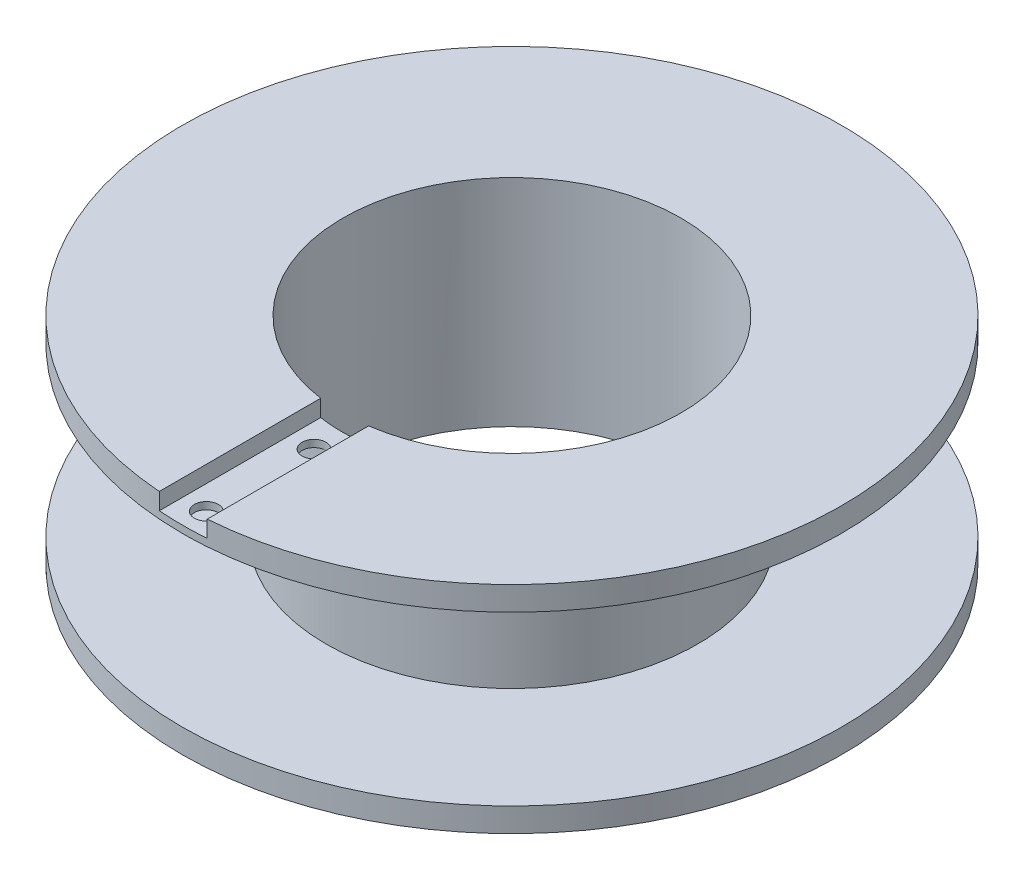
ISO-10303-21;
HEADER;
FILE_DESCRIPTION(('STEP AP214'),'2;1');
FILE_NAME('part.step','',(''),(''),'','','');
FILE_SCHEMA(('AUTOMOTIVE_DESIGN { 1 0 10303 214 1 1 1 1 }'));
ENDSEC;
DATA;
#1=APPLICATION_CONTEXT('core data for automotive mechanical design processes');
#2=APPLICATION_PROTOCOL_DEFINITION('international standard','automotive_design',2000,#1);
#3=PRODUCT_CONTEXT('',#1,'mechanical');
#4=PRODUCT('Part','Part','',(#3));
#5=PRODUCT_RELATED_PRODUCT_CATEGORY('part','',(#4));
#6=PRODUCT_DEFINITION_FORMATION('','',#4);
#7=PRODUCT_DEFINITION_CONTEXT('part definition',#1,'design');
#8=PRODUCT_DEFINITION('design','',#6,#7);
#9=PRODUCT_DEFINITION_SHAPE('','',#8);
#10=(LENGTH_UNIT() NAMED_UNIT(*) SI_UNIT(.MILLI.,.METRE.));
#11=(NAMED_UNIT(*) PLANE_ANGLE_UNIT() SI_UNIT($,.RADIAN.));
#12=(NAMED_UNIT(*) SI_UNIT($,.STERADIAN.) SOLID_ANGLE_UNIT());
#13=UNCERTAINTY_MEASURE_WITH_UNIT(LENGTH_MEASURE(1.E-05),#10,'distance_accuracy_value','');
#14=(GEOMETRIC_REPRESENTATION_CONTEXT(3) GLOBAL_UNCERTAINTY_ASSIGNED_CONTEXT((#13)) GLOBAL_UNIT_ASSIGNED_CONTEXT((#10,
#11,#12)) REPRESENTATION_CONTEXT('',''));
#15=CARTESIAN_POINT('',(0.,0.,0.));
#16=DIRECTION('',(0.,0.,1.));
#17=DIRECTION('',(1.,0.,0.));
#18=AXIS2_PLACEMENT_3D('',#15,#16,#17);
#19=CARTESIAN_POINT('',(0.,9.,0.));
#20=DIRECTION('',(0.,-1.,0.));
#21=DIRECTION('',(0.,0.,-1.));
#22=AXIS2_PLACEMENT_3D('',#19,#20,#21);
#23=CYLINDRICAL_SURFACE('',#22,13.75);
#24=CARTESIAN_POINT('',(0.,0.,0.));
#25=DIRECTION('',(0.,1.,0.));
#26=DIRECTION('',(0.,0.,1.));
#27=AXIS2_PLACEMENT_3D('',#24,#25,#26);
#28=CIRCLE('',#27,13.75);
#29=CARTESIAN_POINT('',(0.,0.,13.75));
#30=VERTEX_POINT('',#29);
#31=EDGE_CURVE('E110',#30,#30,#28,.T.);
#32=ORIENTED_EDGE('',*,*,#31,.T.);
#33=EDGE_LOOP('',(#32));
#34=FACE_BOUND('',#33,.T.);
#35=CARTESIAN_POINT('',(0.,0.999999999999999,0.));
#36=DIRECTION('',(0.,1.,0.));
#37=DIRECTION('',(0.,0.,1.));
#38=AXIS2_PLACEMENT_3D('',#35,#36,#37);
#39=CIRCLE('',#38,13.75);
#40=CARTESIAN_POINT('',(0.,0.999999999999999,13.75));
#41=VERTEX_POINT('',#40);
#42=EDGE_CURVE('E113',#41,#41,#39,.T.);
#43=ORIENTED_EDGE('',*,*,#42,.F.);
#44=EDGE_LOOP('',(#43));
#45=FACE_BOUND('',#44,.T.);
#46=ADVANCED_FACE('F33',(#34,#45),#23,.T.);
#47=CARTESIAN_POINT('',(0.,0.,0.));
#48=DIRECTION('',(0.,1.,0.));
#49=DIRECTION('',(0.,0.,1.));
#50=AXIS2_PLACEMENT_3D('',#47,#48,#49);
#51=PLANE('',#50);
#52=CARTESIAN_POINT('',(0.,0.,0.));
#53=DIRECTION('',(0.,1.,0.));
#54=DIRECTION('',(0.,0.,1.));
#55=AXIS2_PLACEMENT_3D('',#52,#53,#54);
#56=CIRCLE('',#55,7.05);
#57=CARTESIAN_POINT('',(0.,0.,7.05));
#58=VERTEX_POINT('',#57);
#59=EDGE_CURVE('E92',#58,#58,#56,.F.);
#60=ORIENTED_EDGE('',*,*,#59,.F.);
#61=EDGE_LOOP('',(#60));
#62=FACE_BOUND('',#61,.T.);
#63=ORIENTED_EDGE('',*,*,#31,.F.);
#64=EDGE_LOOP('',(#63));
#65=FACE_BOUND('',#64,.T.);
#66=ADVANCED_FACE('F164',(#62,#65),#51,.F.);
#67=CARTESIAN_POINT('',(0.,1.,0.));
#68=DIRECTION('',(0.,1.,0.));
#69=DIRECTION('',(0.,0.,1.));
#70=AXIS2_PLACEMENT_3D('',#67,#68,#69);
#71=PLANE('',#70);
#72=CARTESIAN_POINT('',(0.,1.,0.));
#73=DIRECTION('',(0.,1.,0.));
#74=DIRECTION('',(0.,0.,1.));
#75=AXIS2_PLACEMENT_3D('',#72,#73,#74);
#76=CIRCLE('',#75,7.75);
#77=CARTESIAN_POINT('',(0.,1.,7.75));
#78=VERTEX_POINT('',#77);
#79=EDGE_CURVE('E103',#78,#78,#76,.T.);
#80=ORIENTED_EDGE('',*,*,#79,.F.);
#81=EDGE_LOOP('',(#80));
#82=FACE_BOUND('',#81,.T.);
#83=ORIENTED_EDGE('',*,*,#42,.T.);
#84=EDGE_LOOP('',(#83));
#85=FACE_BOUND('',#84,.T.);
#86=ADVANCED_FACE('F146',(#82,#85),#71,.T.);
#87=CARTESIAN_POINT('',(0.,8.,0.));
#88=DIRECTION('',(0.,1.,0.));
#89=DIRECTION('',(0.,0.,1.));
#90=AXIS2_PLACEMENT_3D('',#87,#88,#89);
#91=PLANE('',#90);
#92=CARTESIAN_POINT('',(0.,8.,12.75));
#93=DIRECTION('',(0.,1.,0.));
#94=DIRECTION('',(0.,0.,1.));
#95=AXIS2_PLACEMENT_3D('',#92,#93,#94);
#96=CIRCLE('',#95,0.499999999999999);
#97=CARTESIAN_POINT('',(0.,8.,13.25));
#98=VERTEX_POINT('',#97);
#99=EDGE_CURVE('E99',#98,#98,#96,.F.);
#100=ORIENTED_EDGE('',*,*,#99,.F.);
#101=EDGE_LOOP('',(#100));
#102=FACE_BOUND('',#101,.T.);
#103=CARTESIAN_POINT('',(0.,8.,8.2562837938334));
#104=DIRECTION('',(0.,1.,0.));
#105=DIRECTION('',(0.,0.,1.));
#106=AXIS2_PLACEMENT_3D('',#103,#104,#105);
#107=CIRCLE('',#106,0.5);
#108=CARTESIAN_POINT('',(0.,8.,8.7562837938334));
#109=VERTEX_POINT('',#108);
#110=EDGE_CURVE('E93',#109,#109,#107,.F.);
#111=ORIENTED_EDGE('',*,*,#110,.F.);
#112=EDGE_LOOP('',(#111));
#113=FACE_BOUND('',#112,.T.);
#114=CARTESIAN_POINT('',(0.,8.,0.));
#115=DIRECTION('',(0.,1.,0.));
#116=DIRECTION('',(0.,0.,1.));
#117=AXIS2_PLACEMENT_3D('',#114,#115,#116);
#118=CIRCLE('',#117,7.75);
#119=CARTESIAN_POINT('',(0.,8.,7.75));
#120=VERTEX_POINT('',#119);
#121=EDGE_CURVE('E96',#120,#120,#118,.T.);
#122=ORIENTED_EDGE('',*,*,#121,.T.);
#123=EDGE_LOOP('',(#122));
#124=FACE_BOUND('',#123,.T.);
#125=CARTESIAN_POINT('',(0.,8.,0.));
#126=DIRECTION('',(0.,1.,0.));
#127=DIRECTION('',(0.,0.,1.));
#128=AXIS2_PLACEMENT_3D('',#125,#126,#127);
#129=CIRCLE('',#128,13.75);
#130=CARTESIAN_POINT('',(0.,8.,13.75));
#131=VERTEX_POINT('',#130);
#132=EDGE_CURVE('E106',#131,#131,#129,.T.);
#133=ORIENTED_EDGE('',*,*,#132,.F.);
#134=EDGE_LOOP('',(#133));
#135=FACE_BOUND('',#134,.T.);
#136=ADVANCED_FACE('F142',(#102,#113,#124,#135),#91,.F.);
#137=CARTESIAN_POINT('',(0.,1.,0.));
#138=DIRECTION('',(0.,1.,0.));
#139=DIRECTION('',(0.,0.,1.));
#140=AXIS2_PLACEMENT_3D('',#137,#138,#139);
#141=CYLINDRICAL_SURFACE('',#140,7.75);
#142=ORIENTED_EDGE('',*,*,#79,.T.);
#143=EDGE_LOOP('',(#142));
#144=FACE_BOUND('',#143,.T.);
#145=ORIENTED_EDGE('',*,*,#121,.F.);
#146=EDGE_LOOP('',(#145));
#147=FACE_BOUND('',#146,.T.);
#148=ADVANCED_FACE('F145',(#144,#147),#141,.T.);
#149=CARTESIAN_POINT('',(0.,9.,0.));
#150=DIRECTION('',(0.,1.,0.));
#151=DIRECTION('',(0.,0.,1.));
#152=AXIS2_PLACEMENT_3D('',#149,#150,#151);
#153=PLANE('',#152);
#154=DIRECTION('',(0.,0.,-1.));
#155=VECTOR('',#154,1.);
#156=CARTESIAN_POINT('',(1.,9.,0.));
#157=LINE('',#156,#155);
#158=CARTESIAN_POINT('',(1.,9.,13.7135881519025));
#159=VERTEX_POINT('',#158);
#160=CARTESIAN_POINT('',(1.,9.,6.97871764724724));
#161=VERTEX_POINT('',#160);
#162=EDGE_CURVE('E88',#159,#161,#157,.T.);
#163=ORIENTED_EDGE('',*,*,#162,.F.);
#164=CARTESIAN_POINT('',(0.,9.,0.));
#165=DIRECTION('',(0.,1.,0.));
#166=DIRECTION('',(0.,0.,1.));
#167=AXIS2_PLACEMENT_3D('',#164,#165,#166);
#168=CIRCLE('',#167,13.75);
#169=CARTESIAN_POINT('',(-1.,9.,13.7135881519025));
#170=VERTEX_POINT('',#169);
#171=EDGE_CURVE('E80',#159,#170,#168,.T.);
#172=ORIENTED_EDGE('',*,*,#171,.T.);
#173=DIRECTION('',(0.,0.,1.));
#174=VECTOR('',#173,1.);
#175=CARTESIAN_POINT('',(-1.,9.,0.));
#176=LINE('',#175,#174);
#177=CARTESIAN_POINT('',(-1.,9.,6.97871764724724));
#178=VERTEX_POINT('',#177);
#179=EDGE_CURVE('E75',#178,#170,#176,.T.);
#180=ORIENTED_EDGE('',*,*,#179,.F.);
#181=CARTESIAN_POINT('',(0.,9.,0.));
#182=DIRECTION('',(0.,1.,0.));
#183=DIRECTION('',(0.,0.,1.));
#184=AXIS2_PLACEMENT_3D('',#181,#182,#183);
#185=CIRCLE('',#184,7.05);
#186=EDGE_CURVE('E86',#161,#178,#185,.T.);
#187=ORIENTED_EDGE('',*,*,#186,.F.);
#188=EDGE_LOOP('',(#163,#172,#180,#187));
#189=FACE_BOUND('',#188,.T.);
#190=ADVANCED_FACE('F85',(#189),#153,.T.);
#191=ORIENTED_EDGE('',*,*,#171,.F.);
#192=DIRECTION('',(0.,-1.,0.));
#193=VECTOR('',#192,1.);
#194=CARTESIAN_POINT('',(1.,9.,13.7135881519025));
#195=LINE('',#194,#193);
#196=CARTESIAN_POINT('',(1.,8.3,13.7135881519025));
#197=VERTEX_POINT('',#196);
#198=EDGE_CURVE('E135',#159,#197,#195,.T.);
#199=ORIENTED_EDGE('',*,*,#198,.T.);
#200=CARTESIAN_POINT('',(0.,8.3,0.));
#201=DIRECTION('',(0.,-1.,0.));
#202=DIRECTION('',(0.,0.,-1.));
#203=AXIS2_PLACEMENT_3D('',#200,#201,#202);
#204=CIRCLE('',#203,13.75);
#205=CARTESIAN_POINT('',(-1.,8.3,13.7135881519025));
#206=VERTEX_POINT('',#205);
#207=EDGE_CURVE('E131',#197,#206,#204,.T.);
#208=ORIENTED_EDGE('',*,*,#207,.T.);
#209=DIRECTION('',(0.,-1.,0.));
#210=VECTOR('',#209,1.);
#211=CARTESIAN_POINT('',(-1.,9.,13.7135881519025));
#212=LINE('',#211,#210);
#213=EDGE_CURVE('E56',#206,#170,#212,.F.);
#214=ORIENTED_EDGE('',*,*,#213,.T.);
#215=EDGE_LOOP('',(#191,#199,#208,#214));
#216=FACE_BOUND('',#215,.T.);
#217=ORIENTED_EDGE('',*,*,#132,.T.);
#218=EDGE_LOOP('',(#217));
#219=FACE_BOUND('',#218,.T.);
#220=ADVANCED_FACE('F35',(#216,#219),#23,.T.);
#221=CARTESIAN_POINT('',(0.,-0.000999999999999265,0.));
#222=DIRECTION('',(0.,1.,0.));
#223=DIRECTION('',(0.,0.,1.));
#224=AXIS2_PLACEMENT_3D('',#221,#222,#223);
#225=CYLINDRICAL_SURFACE('',#224,7.05);
#226=CARTESIAN_POINT('',(0.,8.3,0.));
#227=DIRECTION('',(0.,-1.,0.));
#228=DIRECTION('',(0.,0.,-1.));
#229=AXIS2_PLACEMENT_3D('',#226,#227,#228);
#230=CIRCLE('',#229,7.05);
#231=CARTESIAN_POINT('',(-1.,8.3,6.97871764724724));
#232=VERTEX_POINT('',#231);
#233=CARTESIAN_POINT('',(1.,8.3,6.97871764724724));
#234=VERTEX_POINT('',#233);
#235=EDGE_CURVE('E124',#232,#234,#230,.F.);
#236=ORIENTED_EDGE('',*,*,#235,.T.);
#237=DIRECTION('',(0.,1.,0.));
#238=VECTOR('',#237,1.);
#239=CARTESIAN_POINT('',(1.,-0.000999999999999265,6.97871764724724));
#240=LINE('',#239,#238);
#241=EDGE_CURVE('E12',#234,#161,#240,.T.);
#242=ORIENTED_EDGE('',*,*,#241,.T.);
#243=ORIENTED_EDGE('',*,*,#186,.T.);
#244=DIRECTION('',(0.,1.,0.));
#245=VECTOR('',#244,1.);
#246=CARTESIAN_POINT('',(-1.,-0.000999999999999265,6.97871764724724));
#247=LINE('',#246,#245);
#248=EDGE_CURVE('E41',#178,#232,#247,.F.);
#249=ORIENTED_EDGE('',*,*,#248,.T.);
#250=EDGE_LOOP('',(#236,#242,#243,#249));
#251=FACE_BOUND('',#250,.T.);
#252=ORIENTED_EDGE('',*,*,#59,.T.);
#253=EDGE_LOOP('',(#252));
#254=FACE_BOUND('',#253,.T.);
#255=ADVANCED_FACE('F90',(#251,#254),#225,.F.);
#256=CARTESIAN_POINT('',(0.,-0.000999999999999265,8.2562837938334));
#257=DIRECTION('',(0.,1.,0.));
#258=DIRECTION('',(0.,0.,1.));
#259=AXIS2_PLACEMENT_3D('',#256,#257,#258);
#260=CYLINDRICAL_SURFACE('',#259,0.5);
#261=CARTESIAN_POINT('',(0.,8.3,8.2562837938334));
#262=DIRECTION('',(0.,-1.,0.));
#263=DIRECTION('',(0.,0.,-1.));
#264=AXIS2_PLACEMENT_3D('',#261,#262,#263);
#265=CIRCLE('',#264,0.5);
#266=CARTESIAN_POINT('',(0.,8.3,7.7562837938334));
#267=VERTEX_POINT('',#266);
#268=EDGE_CURVE('E120',#267,#267,#265,.F.);
#269=ORIENTED_EDGE('',*,*,#268,.T.);
#270=EDGE_LOOP('',(#269));
#271=FACE_BOUND('',#270,.T.);
#272=ORIENTED_EDGE('',*,*,#110,.T.);
#273=EDGE_LOOP('',(#272));
#274=FACE_BOUND('',#273,.T.);
#275=ADVANCED_FACE('F160',(#271,#274),#260,.F.);
#276=CARTESIAN_POINT('',(0.,-0.000999999999999265,12.75));
#277=DIRECTION('',(0.,1.,0.));
#278=DIRECTION('',(0.,0.,1.));
#279=AXIS2_PLACEMENT_3D('',#276,#277,#278);
#280=CYLINDRICAL_SURFACE('',#279,0.499999999999999);
#281=CARTESIAN_POINT('',(0.,8.3,12.75));
#282=DIRECTION('',(0.,-1.,0.));
#283=DIRECTION('',(0.,0.,-1.));
#284=AXIS2_PLACEMENT_3D('',#281,#282,#283);
#285=CIRCLE('',#284,0.499999999999999);
#286=CARTESIAN_POINT('',(0.,8.3,12.25));
#287=VERTEX_POINT('',#286);
#288=EDGE_CURVE('E118',#287,#287,#285,.F.);
#289=ORIENTED_EDGE('',*,*,#288,.T.);
#290=EDGE_LOOP('',(#289));
#291=FACE_BOUND('',#290,.T.);
#292=ORIENTED_EDGE('',*,*,#99,.T.);
#293=EDGE_LOOP('',(#292));
#294=FACE_BOUND('',#293,.T.);
#295=ADVANCED_FACE('F140',(#291,#294),#280,.F.);
#296=CARTESIAN_POINT('',(1.,8.3,0.));
#297=DIRECTION('',(1.,0.,0.));
#298=DIRECTION('',(0.,0.,-1.));
#299=AXIS2_PLACEMENT_3D('',#296,#297,#298);
#300=PLANE('',#299);
#301=ORIENTED_EDGE('',*,*,#162,.T.);
#302=ORIENTED_EDGE('',*,*,#241,.F.);
#303=DIRECTION('',(0.,0.,-1.));
#304=VECTOR('',#303,1.);
#305=CARTESIAN_POINT('',(1.,8.3,0.));
#306=LINE('',#305,#304);
#307=EDGE_CURVE('E48',#197,#234,#306,.T.);
#308=ORIENTED_EDGE('',*,*,#307,.F.);
#309=ORIENTED_EDGE('',*,*,#198,.F.);
#310=EDGE_LOOP('',(#301,#302,#308,#309));
#311=FACE_BOUND('',#310,.T.);
#312=ADVANCED_FACE('F189',(#311),#300,.F.);
#313=CARTESIAN_POINT('',(-1.,8.3,0.));
#314=DIRECTION('',(-1.,0.,0.));
#315=DIRECTION('',(0.,0.,1.));
#316=AXIS2_PLACEMENT_3D('',#313,#314,#315);
#317=PLANE('',#316);
#318=DIRECTION('',(0.,0.,1.));
#319=VECTOR('',#318,1.);
#320=CARTESIAN_POINT('',(-1.,8.3,0.));
#321=LINE('',#320,#319);
#322=EDGE_CURVE('E76',#232,#206,#321,.T.);
#323=ORIENTED_EDGE('',*,*,#322,.F.);
#324=ORIENTED_EDGE('',*,*,#248,.F.);
#325=ORIENTED_EDGE('',*,*,#179,.T.);
#326=ORIENTED_EDGE('',*,*,#213,.F.);
#327=EDGE_LOOP('',(#323,#324,#325,#326));
#328=FACE_BOUND('',#327,.T.);
#329=ADVANCED_FACE('F74',(#328),#317,.F.);
#330=CARTESIAN_POINT('',(1.,8.3,0.));
#331=DIRECTION('',(0.,-1.,0.));
#332=DIRECTION('',(0.,0.,-1.));
#333=AXIS2_PLACEMENT_3D('',#330,#331,#332);
#334=PLANE('',#333);
#335=ORIENTED_EDGE('',*,*,#288,.F.);
#336=EDGE_LOOP('',(#335));
#337=FACE_BOUND('',#336,.T.);
#338=ORIENTED_EDGE('',*,*,#268,.F.);
#339=EDGE_LOOP('',(#338));
#340=FACE_BOUND('',#339,.T.);
#341=ORIENTED_EDGE('',*,*,#307,.T.);
#342=ORIENTED_EDGE('',*,*,#235,.F.);
#343=ORIENTED_EDGE('',*,*,#322,.T.);
#344=ORIENTED_EDGE('',*,*,#207,.F.);
#345=EDGE_LOOP('',(#341,#342,#343,#344));
#346=FACE_BOUND('',#345,.T.);
#347=ADVANCED_FACE('F192',(#337,#340,#346),#334,.F.);
#348=CLOSED_SHELL('',(#46,#66,#86,#136,#148,#190,#220,#255,#275,#295,#312,#329,#347));
#349=MANIFOLD_SOLID_BREP('B2',#348);
#350=ADVANCED_BREP_SHAPE_REPRESENTATION('',(#18,#349),#14);
#351=SHAPE_DEFINITION_REPRESENTATION(#9,#350);
ENDSEC;
END-ISO-10303-21;
